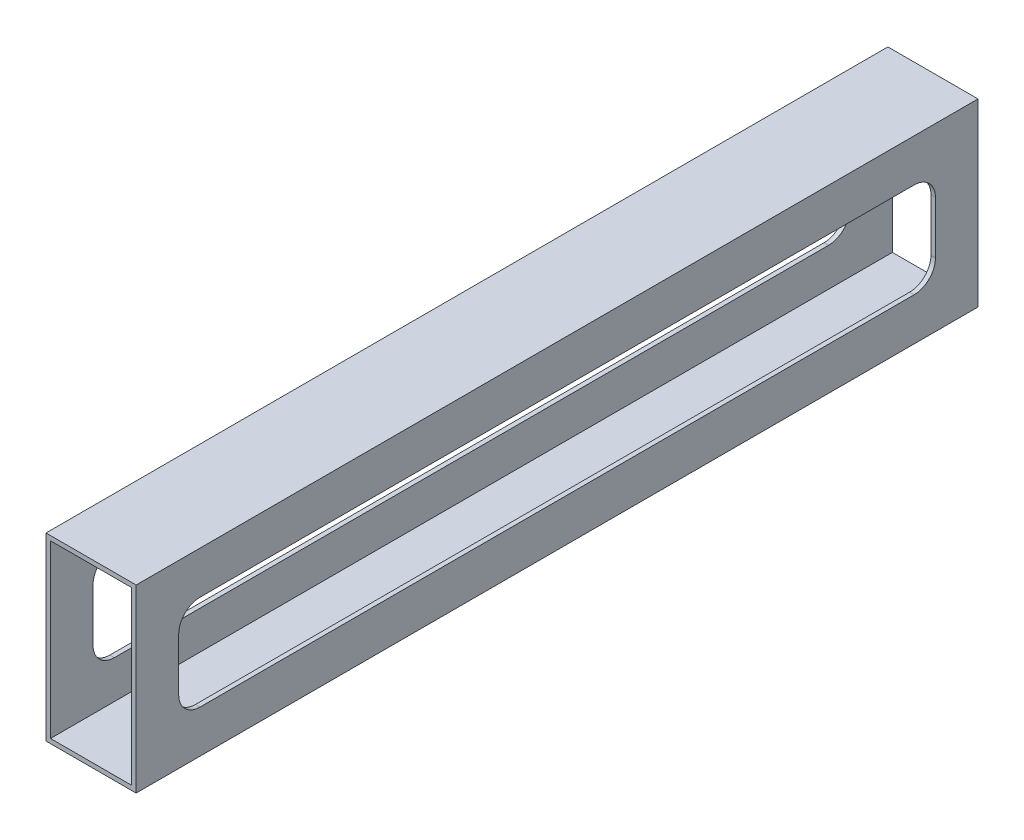
ISO-10303-21;
HEADER;
FILE_DESCRIPTION(('STEP AP214'),'2;1');
FILE_NAME('part.step','',(''),(''),'','','');
FILE_SCHEMA(('AUTOMOTIVE_DESIGN { 1 0 10303 214 1 1 1 1 }'));
ENDSEC;
DATA;
#1=APPLICATION_CONTEXT('core data for automotive mechanical design processes');
#2=APPLICATION_PROTOCOL_DEFINITION('international standard','automotive_design',2000,#1);
#3=PRODUCT_CONTEXT('',#1,'mechanical');
#4=PRODUCT('Part','Part','',(#3));
#5=PRODUCT_RELATED_PRODUCT_CATEGORY('part','',(#4));
#6=PRODUCT_DEFINITION_FORMATION('','',#4);
#7=PRODUCT_DEFINITION_CONTEXT('part definition',#1,'design');
#8=PRODUCT_DEFINITION('design','',#6,#7);
#9=PRODUCT_DEFINITION_SHAPE('','',#8);
#10=(LENGTH_UNIT() NAMED_UNIT(*) SI_UNIT(.MILLI.,.METRE.));
#11=(NAMED_UNIT(*) PLANE_ANGLE_UNIT() SI_UNIT($,.RADIAN.));
#12=(NAMED_UNIT(*) SI_UNIT($,.STERADIAN.) SOLID_ANGLE_UNIT());
#13=UNCERTAINTY_MEASURE_WITH_UNIT(LENGTH_MEASURE(1.E-05),#10,'distance_accuracy_value','');
#14=(GEOMETRIC_REPRESENTATION_CONTEXT(3) GLOBAL_UNCERTAINTY_ASSIGNED_CONTEXT((#13)) GLOBAL_UNIT_ASSIGNED_CONTEXT((#10,
#11,#12)) REPRESENTATION_CONTEXT('',''));
#15=CARTESIAN_POINT('',(0.,0.,0.));
#16=DIRECTION('',(0.,0.,1.));
#17=DIRECTION('',(1.,0.,0.));
#18=AXIS2_PLACEMENT_3D('',#15,#16,#17);
#19=CARTESIAN_POINT('',(0.,0.,0.));
#20=DIRECTION('',(0.,0.,-1.));
#21=DIRECTION('',(-1.,0.,0.));
#22=AXIS2_PLACEMENT_3D('',#19,#20,#21);
#23=PLANE('',#22);
#24=DIRECTION('',(0.,1.,0.));
#25=VECTOR('',#24,1.);
#26=CARTESIAN_POINT('',(-89.9570653423027,-37.2794955536291,0.));
#27=LINE('',#26,#25);
#28=CARTESIAN_POINT('',(-89.9570653423027,-37.2794955536291,0.));
#29=VERTEX_POINT('',#28);
#30=CARTESIAN_POINT('',(-89.9570653423027,13.5205044463709,0.));
#31=VERTEX_POINT('',#30);
#32=EDGE_CURVE('E312',#29,#31,#27,.T.);
#33=ORIENTED_EDGE('',*,*,#32,.F.);
#34=DIRECTION('',(1.,0.,0.));
#35=VECTOR('',#34,1.);
#36=CARTESIAN_POINT('',(-115.357065342303,-37.2794955536291,0.));
#37=LINE('',#36,#35);
#38=CARTESIAN_POINT('',(-115.357065342303,-37.2794955536291,0.));
#39=VERTEX_POINT('',#38);
#40=EDGE_CURVE('E297',#39,#29,#37,.T.);
#41=ORIENTED_EDGE('',*,*,#40,.F.);
#42=DIRECTION('',(0.,-1.,0.));
#43=VECTOR('',#42,1.);
#44=CARTESIAN_POINT('',(-115.357065342303,-37.2794955536291,0.));
#45=LINE('',#44,#43);
#46=CARTESIAN_POINT('',(-115.357065342303,13.5205044463709,0.));
#47=VERTEX_POINT('',#46);
#48=EDGE_CURVE('E302',#47,#39,#45,.T.);
#49=ORIENTED_EDGE('',*,*,#48,.F.);
#50=DIRECTION('',(-1.,0.,0.));
#51=VECTOR('',#50,1.);
#52=CARTESIAN_POINT('',(-115.357065342303,13.5205044463709,0.));
#53=LINE('',#52,#51);
#54=EDGE_CURVE('E307',#31,#47,#53,.T.);
#55=ORIENTED_EDGE('',*,*,#54,.F.);
#56=EDGE_LOOP('',(#33,#41,#49,#55));
#57=FACE_BOUND('',#56,.T.);
#58=DIRECTION('',(-1.,0.,0.));
#59=VECTOR('',#58,1.);
#60=CARTESIAN_POINT('',(-114.087065342303,12.2505044463709,0.));
#61=LINE('',#60,#59);
#62=CARTESIAN_POINT('',(-91.2270653423027,12.2505044463709,0.));
#63=VERTEX_POINT('',#62);
#64=CARTESIAN_POINT('',(-114.087065342303,12.2505044463709,0.));
#65=VERTEX_POINT('',#64);
#66=EDGE_CURVE('E296',#63,#65,#61,.T.);
#67=ORIENTED_EDGE('',*,*,#66,.T.);
#68=DIRECTION('',(0.,-1.,0.));
#69=VECTOR('',#68,1.);
#70=CARTESIAN_POINT('',(-114.087065342303,-36.0094955536291,0.));
#71=LINE('',#70,#69);
#72=CARTESIAN_POINT('',(-114.087065342303,-36.0094955536291,0.));
#73=VERTEX_POINT('',#72);
#74=EDGE_CURVE('E319',#65,#73,#71,.T.);
#75=ORIENTED_EDGE('',*,*,#74,.T.);
#76=DIRECTION('',(1.,0.,0.));
#77=VECTOR('',#76,1.);
#78=CARTESIAN_POINT('',(-114.087065342303,-36.0094955536291,0.));
#79=LINE('',#78,#77);
#80=CARTESIAN_POINT('',(-91.2270653423027,-36.0094955536291,0.));
#81=VERTEX_POINT('',#80);
#82=EDGE_CURVE('E324',#73,#81,#79,.T.);
#83=ORIENTED_EDGE('',*,*,#82,.T.);
#84=DIRECTION('',(0.,1.,0.));
#85=VECTOR('',#84,1.);
#86=CARTESIAN_POINT('',(-91.2270653423027,-36.0094955536291,0.));
#87=LINE('',#86,#85);
#88=EDGE_CURVE('E320',#81,#63,#87,.T.);
#89=ORIENTED_EDGE('',*,*,#88,.T.);
#90=EDGE_LOOP('',(#67,#75,#83,#89));
#91=FACE_BOUND('',#90,.T.);
#92=ADVANCED_FACE('F33',(#57,#91),#23,.T.);
#93=CARTESIAN_POINT('',(-89.9570653423027,-37.2794955536291,294.095626628495));
#94=DIRECTION('',(-1.,0.,0.));
#95=DIRECTION('',(0.,0.,1.));
#96=AXIS2_PLACEMENT_3D('',#93,#94,#95);
#97=PLANE('',#96);
#98=DIRECTION('',(0.,0.,1.));
#99=VECTOR('',#98,1.);
#100=CARTESIAN_POINT('',(-89.9570653423027,1.52050444637092,18.));
#101=LINE('',#100,#99);
#102=CARTESIAN_POINT('',(-89.9570653423027,1.52050444637093,18.));
#103=VERTEX_POINT('',#102);
#104=CARTESIAN_POINT('',(-89.9570653423027,1.52050444637092,219.2995));
#105=VERTEX_POINT('',#104);
#106=EDGE_CURVE('E240',#103,#105,#101,.T.);
#107=ORIENTED_EDGE('',*,*,#106,.F.);
#108=CARTESIAN_POINT('',(-89.9570653423027,-4.47949555362908,18.));
#109=DIRECTION('',(1.,0.,0.));
#110=DIRECTION('',(0.,0.,1.));
#111=AXIS2_PLACEMENT_3D('',#108,#109,#110);
#112=CIRCLE('',#111,6.);
#113=CARTESIAN_POINT('',(-89.9570653423027,-4.47949555362908,12.));
#114=VERTEX_POINT('',#113);
#115=EDGE_CURVE('E48',#114,#103,#112,.T.);
#116=ORIENTED_EDGE('',*,*,#115,.F.);
#117=DIRECTION('',(0.,1.,0.));
#118=VECTOR('',#117,1.);
#119=CARTESIAN_POINT('',(-89.9570653423027,-19.2794955536291,12.));
#120=LINE('',#119,#118);
#121=CARTESIAN_POINT('',(-89.9570653423027,-19.2794955536291,12.));
#122=VERTEX_POINT('',#121);
#123=EDGE_CURVE('E220',#122,#114,#120,.T.);
#124=ORIENTED_EDGE('',*,*,#123,.F.);
#125=CARTESIAN_POINT('',(-89.9570653423027,-19.2794955536291,18.));
#126=DIRECTION('',(1.,0.,0.));
#127=DIRECTION('',(0.,0.,-1.));
#128=AXIS2_PLACEMENT_3D('',#125,#126,#127);
#129=CIRCLE('',#128,6.00000000000001);
#130=CARTESIAN_POINT('',(-89.9570653423027,-25.2794955536291,18.));
#131=VERTEX_POINT('',#130);
#132=EDGE_CURVE('E223',#131,#122,#129,.T.);
#133=ORIENTED_EDGE('',*,*,#132,.F.);
#134=DIRECTION('',(0.,0.,-1.));
#135=VECTOR('',#134,1.);
#136=CARTESIAN_POINT('',(-89.9570653423027,-25.2794955536291,219.2995));
#137=LINE('',#136,#135);
#138=CARTESIAN_POINT('',(-89.9570653423027,-25.2794955536291,219.2995));
#139=VERTEX_POINT('',#138);
#140=EDGE_CURVE('E252',#139,#131,#137,.T.);
#141=ORIENTED_EDGE('',*,*,#140,.F.);
#142=CARTESIAN_POINT('',(-89.9570653423027,-19.2794955536291,219.2995));
#143=DIRECTION('',(1.,0.,0.));
#144=DIRECTION('',(0.,0.,-1.));
#145=AXIS2_PLACEMENT_3D('',#142,#143,#144);
#146=CIRCLE('',#145,6.00000000000002);
#147=CARTESIAN_POINT('',(-89.9570653423027,-19.2794955536291,225.2995));
#148=VERTEX_POINT('',#147);
#149=EDGE_CURVE('E249',#148,#139,#146,.T.);
#150=ORIENTED_EDGE('',*,*,#149,.F.);
#151=DIRECTION('',(0.,-1.,0.));
#152=VECTOR('',#151,1.);
#153=CARTESIAN_POINT('',(-89.9570653423027,-4.47949555362908,225.2995));
#154=LINE('',#153,#152);
#155=CARTESIAN_POINT('',(-89.9570653423027,-4.47949555362908,225.2995));
#156=VERTEX_POINT('',#155);
#157=EDGE_CURVE('E246',#156,#148,#154,.T.);
#158=ORIENTED_EDGE('',*,*,#157,.F.);
#159=CARTESIAN_POINT('',(-89.9570653423027,-4.47949555362908,219.2995));
#160=DIRECTION('',(1.,0.,0.));
#161=DIRECTION('',(0.,0.,-1.));
#162=AXIS2_PLACEMENT_3D('',#159,#160,#161);
#163=CIRCLE('',#162,6.00000000000002);
#164=EDGE_CURVE('E243',#105,#156,#163,.T.);
#165=ORIENTED_EDGE('',*,*,#164,.F.);
#166=EDGE_LOOP('',(#107,#116,#124,#133,#141,#150,#158,#165));
#167=FACE_BOUND('',#166,.T.);
#168=DIRECTION('',(0.,0.,-1.));
#169=VECTOR('',#168,1.);
#170=CARTESIAN_POINT('',(-89.9570653423027,13.5205044463709,294.095626628495));
#171=LINE('',#170,#169);
#172=CARTESIAN_POINT('',(-89.9570653423027,13.5205044463709,237.2995));
#173=VERTEX_POINT('',#172);
#174=EDGE_CURVE('E311',#173,#31,#171,.T.);
#175=ORIENTED_EDGE('',*,*,#174,.F.);
#176=DIRECTION('',(0.,-1.,0.));
#177=VECTOR('',#176,1.);
#178=CARTESIAN_POINT('',(-89.9570653423027,-37.2794955536291,237.2995));
#179=LINE('',#178,#177);
#180=CARTESIAN_POINT('',(-89.9570653423027,-37.2794955536291,237.2995));
#181=VERTEX_POINT('',#180);
#182=EDGE_CURVE('E323',#173,#181,#179,.T.);
#183=ORIENTED_EDGE('',*,*,#182,.T.);
#184=DIRECTION('',(0.,0.,-1.));
#185=VECTOR('',#184,1.);
#186=CARTESIAN_POINT('',(-89.9570653423027,-37.2794955536291,294.095626628495));
#187=LINE('',#186,#185);
#188=EDGE_CURVE('E316',#181,#29,#187,.T.);
#189=ORIENTED_EDGE('',*,*,#188,.T.);
#190=ORIENTED_EDGE('',*,*,#32,.T.);
#191=EDGE_LOOP('',(#175,#183,#189,#190));
#192=FACE_BOUND('',#191,.T.);
#193=ADVANCED_FACE('F397',(#167,#192),#97,.F.);
#194=CARTESIAN_POINT('',(-115.357065342303,13.5205044463709,294.095626628495));
#195=DIRECTION('',(0.,-1.,0.));
#196=DIRECTION('',(0.,0.,-1.));
#197=AXIS2_PLACEMENT_3D('',#194,#195,#196);
#198=PLANE('',#197);
#199=DIRECTION('',(0.,0.,-1.));
#200=VECTOR('',#199,1.);
#201=CARTESIAN_POINT('',(-115.357065342303,13.5205044463709,294.095626628495));
#202=LINE('',#201,#200);
#203=CARTESIAN_POINT('',(-115.357065342303,13.5205044463709,237.2995));
#204=VERTEX_POINT('',#203);
#205=EDGE_CURVE('E306',#204,#47,#202,.T.);
#206=ORIENTED_EDGE('',*,*,#205,.F.);
#207=DIRECTION('',(1.,0.,0.));
#208=VECTOR('',#207,1.);
#209=CARTESIAN_POINT('',(-115.357065342303,13.5205044463709,237.2995));
#210=LINE('',#209,#208);
#211=EDGE_CURVE('E315',#204,#173,#210,.T.);
#212=ORIENTED_EDGE('',*,*,#211,.T.);
#213=ORIENTED_EDGE('',*,*,#174,.T.);
#214=ORIENTED_EDGE('',*,*,#54,.T.);
#215=EDGE_LOOP('',(#206,#212,#213,#214));
#216=FACE_BOUND('',#215,.T.);
#217=ADVANCED_FACE('F429',(#216),#198,.F.);
#218=CARTESIAN_POINT('',(-115.357065342303,-37.2794955536291,294.095626628495));
#219=DIRECTION('',(1.,0.,0.));
#220=DIRECTION('',(0.,1.,0.));
#221=AXIS2_PLACEMENT_3D('',#218,#219,#220);
#222=PLANE('',#221);
#223=DIRECTION('',(0.,1.,0.));
#224=VECTOR('',#223,1.);
#225=CARTESIAN_POINT('',(-115.357065342303,-19.2794955536291,12.));
#226=LINE('',#225,#224);
#227=CARTESIAN_POINT('',(-115.357065342303,-19.2794955536291,12.));
#228=VERTEX_POINT('',#227);
#229=CARTESIAN_POINT('',(-115.357065342303,-4.47949555362908,12.));
#230=VERTEX_POINT('',#229);
#231=EDGE_CURVE('E219',#228,#230,#226,.T.);
#232=ORIENTED_EDGE('',*,*,#231,.T.);
#233=CARTESIAN_POINT('',(-115.357065342303,-4.47949555362908,18.));
#234=DIRECTION('',(1.,0.,0.));
#235=DIRECTION('',(0.,0.,1.));
#236=AXIS2_PLACEMENT_3D('',#233,#234,#235);
#237=CIRCLE('',#236,6.);
#238=CARTESIAN_POINT('',(-115.357065342303,1.52050444637092,18.));
#239=VERTEX_POINT('',#238);
#240=EDGE_CURVE('E200',#230,#239,#237,.T.);
#241=ORIENTED_EDGE('',*,*,#240,.T.);
#242=DIRECTION('',(0.,0.,1.));
#243=VECTOR('',#242,1.);
#244=CARTESIAN_POINT('',(-115.357065342303,1.52050444637092,18.));
#245=LINE('',#244,#243);
#246=CARTESIAN_POINT('',(-115.357065342303,1.52050444637093,219.2995));
#247=VERTEX_POINT('',#246);
#248=EDGE_CURVE('E210',#239,#247,#245,.T.);
#249=ORIENTED_EDGE('',*,*,#248,.T.);
#250=CARTESIAN_POINT('',(-115.357065342303,-4.47949555362908,219.2995));
#251=DIRECTION('',(1.,0.,0.));
#252=DIRECTION('',(0.,0.,-1.));
#253=AXIS2_PLACEMENT_3D('',#250,#251,#252);
#254=CIRCLE('',#253,6.00000000000002);
#255=CARTESIAN_POINT('',(-115.357065342303,-4.47949555362908,225.2995));
#256=VERTEX_POINT('',#255);
#257=EDGE_CURVE('E56',#247,#256,#254,.T.);
#258=ORIENTED_EDGE('',*,*,#257,.T.);
#259=DIRECTION('',(0.,-1.,0.));
#260=VECTOR('',#259,1.);
#261=CARTESIAN_POINT('',(-115.357065342303,-4.47949555362908,225.2995));
#262=LINE('',#261,#260);
#263=CARTESIAN_POINT('',(-115.357065342303,-19.2794955536291,225.2995));
#264=VERTEX_POINT('',#263);
#265=EDGE_CURVE('E227',#256,#264,#262,.T.);
#266=ORIENTED_EDGE('',*,*,#265,.T.);
#267=CARTESIAN_POINT('',(-115.357065342303,-19.2794955536291,219.2995));
#268=DIRECTION('',(1.,0.,0.));
#269=DIRECTION('',(0.,0.,-1.));
#270=AXIS2_PLACEMENT_3D('',#267,#268,#269);
#271=CIRCLE('',#270,6.00000000000002);
#272=CARTESIAN_POINT('',(-115.357065342303,-25.2794955536291,219.2995));
#273=VERTEX_POINT('',#272);
#274=EDGE_CURVE('E230',#264,#273,#271,.T.);
#275=ORIENTED_EDGE('',*,*,#274,.T.);
#276=DIRECTION('',(0.,0.,-1.));
#277=VECTOR('',#276,1.);
#278=CARTESIAN_POINT('',(-115.357065342303,-25.2794955536291,219.2995));
#279=LINE('',#278,#277);
#280=CARTESIAN_POINT('',(-115.357065342303,-25.2794955536291,18.));
#281=VERTEX_POINT('',#280);
#282=EDGE_CURVE('E233',#273,#281,#279,.T.);
#283=ORIENTED_EDGE('',*,*,#282,.T.);
#284=CARTESIAN_POINT('',(-115.357065342303,-19.2794955536291,18.));
#285=DIRECTION('',(1.,0.,0.));
#286=DIRECTION('',(0.,0.,-1.));
#287=AXIS2_PLACEMENT_3D('',#284,#285,#286);
#288=CIRCLE('',#287,6.00000000000001);
#289=EDGE_CURVE('E236',#281,#228,#288,.T.);
#290=ORIENTED_EDGE('',*,*,#289,.T.);
#291=EDGE_LOOP('',(#232,#241,#249,#258,#266,#275,#283,#290));
#292=FACE_BOUND('',#291,.T.);
#293=DIRECTION('',(0.,0.,-1.));
#294=VECTOR('',#293,1.);
#295=CARTESIAN_POINT('',(-115.357065342303,-37.2794955536291,294.095626628495));
#296=LINE('',#295,#294);
#297=CARTESIAN_POINT('',(-115.357065342303,-37.2794955536291,237.2995));
#298=VERTEX_POINT('',#297);
#299=EDGE_CURVE('E301',#298,#39,#296,.T.);
#300=ORIENTED_EDGE('',*,*,#299,.F.);
#301=DIRECTION('',(0.,1.,0.));
#302=VECTOR('',#301,1.);
#303=CARTESIAN_POINT('',(-115.357065342303,-37.2794955536291,237.2995));
#304=LINE('',#303,#302);
#305=EDGE_CURVE('E310',#298,#204,#304,.T.);
#306=ORIENTED_EDGE('',*,*,#305,.T.);
#307=ORIENTED_EDGE('',*,*,#205,.T.);
#308=ORIENTED_EDGE('',*,*,#48,.T.);
#309=EDGE_LOOP('',(#300,#306,#307,#308));
#310=FACE_BOUND('',#309,.T.);
#311=ADVANCED_FACE('F215',(#292,#310),#222,.F.);
#312=CARTESIAN_POINT('',(-115.357065342303,-37.2794955536291,294.095626628495));
#313=DIRECTION('',(0.,1.,0.));
#314=DIRECTION('',(0.,0.,1.));
#315=AXIS2_PLACEMENT_3D('',#312,#313,#314);
#316=PLANE('',#315);
#317=ORIENTED_EDGE('',*,*,#188,.F.);
#318=DIRECTION('',(-1.,0.,0.));
#319=VECTOR('',#318,1.);
#320=CARTESIAN_POINT('',(-115.357065342303,-37.2794955536291,237.2995));
#321=LINE('',#320,#319);
#322=EDGE_CURVE('E305',#181,#298,#321,.T.);
#323=ORIENTED_EDGE('',*,*,#322,.T.);
#324=ORIENTED_EDGE('',*,*,#299,.T.);
#325=ORIENTED_EDGE('',*,*,#40,.T.);
#326=EDGE_LOOP('',(#317,#323,#324,#325));
#327=FACE_BOUND('',#326,.T.);
#328=ADVANCED_FACE('F436',(#327),#316,.F.);
#329=CARTESIAN_POINT('',(-114.087065342303,-36.0094955536291,294.095626628495));
#330=DIRECTION('',(1.,0.,0.));
#331=DIRECTION('',(0.,0.,-1.));
#332=AXIS2_PLACEMENT_3D('',#329,#330,#331);
#333=PLANE('',#332);
#334=CARTESIAN_POINT('',(-114.087065342303,-4.47949555362908,18.));
#335=DIRECTION('',(1.,0.,0.));
#336=DIRECTION('',(0.,0.,-1.));
#337=AXIS2_PLACEMENT_3D('',#334,#335,#336);
#338=CIRCLE('',#337,6.);
#339=CARTESIAN_POINT('',(-114.087065342303,-4.47949555362908,12.));
#340=VERTEX_POINT('',#339);
#341=CARTESIAN_POINT('',(-114.087065342303,1.52050444637092,18.));
#342=VERTEX_POINT('',#341);
#343=EDGE_CURVE('E203',#340,#342,#338,.T.);
#344=ORIENTED_EDGE('',*,*,#343,.F.);
#345=DIRECTION('',(0.,1.,0.));
#346=VECTOR('',#345,1.);
#347=CARTESIAN_POINT('',(-114.087065342303,-36.0094955536291,12.));
#348=LINE('',#347,#346);
#349=CARTESIAN_POINT('',(-114.087065342303,-19.2794955536291,12.));
#350=VERTEX_POINT('',#349);
#351=EDGE_CURVE('E293',#350,#340,#348,.T.);
#352=ORIENTED_EDGE('',*,*,#351,.F.);
#353=CARTESIAN_POINT('',(-114.087065342303,-19.2794955536291,18.));
#354=DIRECTION('',(1.,0.,0.));
#355=DIRECTION('',(0.,0.,-1.));
#356=AXIS2_PLACEMENT_3D('',#353,#354,#355);
#357=CIRCLE('',#356,6.00000000000001);
#358=CARTESIAN_POINT('',(-114.087065342303,-25.2794955536291,18.));
#359=VERTEX_POINT('',#358);
#360=EDGE_CURVE('E291',#359,#350,#357,.T.);
#361=ORIENTED_EDGE('',*,*,#360,.F.);
#362=DIRECTION('',(0.,0.,-1.));
#363=VECTOR('',#362,1.);
#364=CARTESIAN_POINT('',(-114.087065342303,-25.2794955536291,294.095626628495));
#365=LINE('',#364,#363);
#366=CARTESIAN_POINT('',(-114.087065342303,-25.2794955536291,219.2995));
#367=VERTEX_POINT('',#366);
#368=EDGE_CURVE('E289',#367,#359,#365,.T.);
#369=ORIENTED_EDGE('',*,*,#368,.F.);
#370=CARTESIAN_POINT('',(-114.087065342303,-19.2794955536291,219.2995));
#371=DIRECTION('',(1.,0.,0.));
#372=DIRECTION('',(0.,0.,-1.));
#373=AXIS2_PLACEMENT_3D('',#370,#371,#372);
#374=CIRCLE('',#373,6.00000000000002);
#375=CARTESIAN_POINT('',(-114.087065342303,-19.2794955536291,225.2995));
#376=VERTEX_POINT('',#375);
#377=EDGE_CURVE('E287',#376,#367,#374,.T.);
#378=ORIENTED_EDGE('',*,*,#377,.F.);
#379=DIRECTION('',(0.,-1.,0.));
#380=VECTOR('',#379,1.);
#381=CARTESIAN_POINT('',(-114.087065342303,-36.0094955536291,225.2995));
#382=LINE('',#381,#380);
#383=CARTESIAN_POINT('',(-114.087065342303,-4.47949555362908,225.2995));
#384=VERTEX_POINT('',#383);
#385=EDGE_CURVE('E285',#384,#376,#382,.T.);
#386=ORIENTED_EDGE('',*,*,#385,.F.);
#387=CARTESIAN_POINT('',(-114.087065342303,-4.47949555362908,219.2995));
#388=DIRECTION('',(1.,0.,0.));
#389=DIRECTION('',(0.,0.,-1.));
#390=AXIS2_PLACEMENT_3D('',#387,#388,#389);
#391=CIRCLE('',#390,6.00000000000002);
#392=CARTESIAN_POINT('',(-114.087065342303,1.52050444637092,219.2995));
#393=VERTEX_POINT('',#392);
#394=EDGE_CURVE('E283',#393,#384,#391,.T.);
#395=ORIENTED_EDGE('',*,*,#394,.F.);
#396=DIRECTION('',(0.,0.,1.));
#397=VECTOR('',#396,1.);
#398=CARTESIAN_POINT('',(-114.087065342303,1.52050444637092,294.095626628495));
#399=LINE('',#398,#397);
#400=EDGE_CURVE('E259',#342,#393,#399,.T.);
#401=ORIENTED_EDGE('',*,*,#400,.F.);
#402=EDGE_LOOP('',(#344,#352,#361,#369,#378,#386,#395,#401));
#403=FACE_BOUND('',#402,.T.);
#404=DIRECTION('',(0.,1.,0.));
#405=VECTOR('',#404,1.);
#406=CARTESIAN_POINT('',(-114.087065342303,-36.0094955536291,237.2995));
#407=LINE('',#406,#405);
#408=CARTESIAN_POINT('',(-114.087065342303,-36.0094955536291,237.2995));
#409=VERTEX_POINT('',#408);
#410=CARTESIAN_POINT('',(-114.087065342303,12.2505044463709,237.2995));
#411=VERTEX_POINT('',#410);
#412=EDGE_CURVE('E332',#409,#411,#407,.T.);
#413=ORIENTED_EDGE('',*,*,#412,.F.);
#414=DIRECTION('',(0.,0.,-1.));
#415=VECTOR('',#414,1.);
#416=CARTESIAN_POINT('',(-114.087065342303,-36.0094955536291,294.095626628495));
#417=LINE('',#416,#415);
#418=EDGE_CURVE('E300',#409,#73,#417,.T.);
#419=ORIENTED_EDGE('',*,*,#418,.T.);
#420=ORIENTED_EDGE('',*,*,#74,.F.);
#421=DIRECTION('',(0.,0.,-1.));
#422=VECTOR('',#421,1.);
#423=CARTESIAN_POINT('',(-114.087065342303,12.2505044463709,294.095626628495));
#424=LINE('',#423,#422);
#425=EDGE_CURVE('E342',#411,#65,#424,.T.);
#426=ORIENTED_EDGE('',*,*,#425,.F.);
#427=EDGE_LOOP('',(#413,#419,#420,#426));
#428=FACE_BOUND('',#427,.T.);
#429=ADVANCED_FACE('F439',(#403,#428),#333,.T.);
#430=CARTESIAN_POINT('',(-114.087065342303,-36.0094955536291,294.095626628495));
#431=DIRECTION('',(0.,1.,0.));
#432=DIRECTION('',(0.,0.,1.));
#433=AXIS2_PLACEMENT_3D('',#430,#431,#432);
#434=PLANE('',#433);
#435=DIRECTION('',(-1.,0.,0.));
#436=VECTOR('',#435,1.);
#437=CARTESIAN_POINT('',(-114.087065342303,-36.0094955536291,237.2995));
#438=LINE('',#437,#436);
#439=CARTESIAN_POINT('',(-91.2270653423027,-36.0094955536291,237.2995));
#440=VERTEX_POINT('',#439);
#441=EDGE_CURVE('E353',#440,#409,#438,.T.);
#442=ORIENTED_EDGE('',*,*,#441,.F.);
#443=DIRECTION('',(0.,0.,-1.));
#444=VECTOR('',#443,1.);
#445=CARTESIAN_POINT('',(-91.2270653423027,-36.0094955536291,294.095626628495));
#446=LINE('',#445,#444);
#447=EDGE_CURVE('E338',#440,#81,#446,.T.);
#448=ORIENTED_EDGE('',*,*,#447,.T.);
#449=ORIENTED_EDGE('',*,*,#82,.F.);
#450=ORIENTED_EDGE('',*,*,#418,.F.);
#451=EDGE_LOOP('',(#442,#448,#449,#450));
#452=FACE_BOUND('',#451,.T.);
#453=ADVANCED_FACE('F452',(#452),#434,.T.);
#454=CARTESIAN_POINT('',(-91.2270653423027,-36.0094955536291,294.095626628495));
#455=DIRECTION('',(-1.,0.,0.));
#456=DIRECTION('',(0.,0.,1.));
#457=AXIS2_PLACEMENT_3D('',#454,#455,#456);
#458=PLANE('',#457);
#459=CARTESIAN_POINT('',(-91.2270653423027,-4.47949555362908,18.));
#460=DIRECTION('',(-1.,0.,0.));
#461=DIRECTION('',(0.,0.,1.));
#462=AXIS2_PLACEMENT_3D('',#459,#460,#461);
#463=CIRCLE('',#462,6.);
#464=CARTESIAN_POINT('',(-91.2270653423027,1.52050444637092,18.));
#465=VERTEX_POINT('',#464);
#466=CARTESIAN_POINT('',(-91.2270653423027,-4.47949555362908,12.));
#467=VERTEX_POINT('',#466);
#468=EDGE_CURVE('E11',#465,#467,#463,.T.);
#469=ORIENTED_EDGE('',*,*,#468,.F.);
#470=DIRECTION('',(0.,0.,-1.));
#471=VECTOR('',#470,1.);
#472=CARTESIAN_POINT('',(-91.2270653423027,1.52050444637092,294.095626628495));
#473=LINE('',#472,#471);
#474=CARTESIAN_POINT('',(-91.2270653423027,1.52050444637092,219.2995));
#475=VERTEX_POINT('',#474);
#476=EDGE_CURVE('E355',#475,#465,#473,.T.);
#477=ORIENTED_EDGE('',*,*,#476,.F.);
#478=CARTESIAN_POINT('',(-91.2270653423027,-4.47949555362908,219.2995));
#479=DIRECTION('',(-1.,0.,0.));
#480=DIRECTION('',(0.,0.,1.));
#481=AXIS2_PLACEMENT_3D('',#478,#479,#480);
#482=CIRCLE('',#481,6.00000000000002);
#483=CARTESIAN_POINT('',(-91.2270653423027,-4.47949555362908,225.2995));
#484=VERTEX_POINT('',#483);
#485=EDGE_CURVE('E358',#484,#475,#482,.T.);
#486=ORIENTED_EDGE('',*,*,#485,.F.);
#487=DIRECTION('',(0.,1.,0.));
#488=VECTOR('',#487,1.);
#489=CARTESIAN_POINT('',(-91.2270653423027,-36.0094955536291,225.2995));
#490=LINE('',#489,#488);
#491=CARTESIAN_POINT('',(-91.2270653423027,-19.2794955536291,225.2995));
#492=VERTEX_POINT('',#491);
#493=EDGE_CURVE('E361',#492,#484,#490,.T.);
#494=ORIENTED_EDGE('',*,*,#493,.F.);
#495=CARTESIAN_POINT('',(-91.2270653423027,-19.2794955536291,219.2995));
#496=DIRECTION('',(-1.,0.,0.));
#497=DIRECTION('',(0.,0.,1.));
#498=AXIS2_PLACEMENT_3D('',#495,#496,#497);
#499=CIRCLE('',#498,6.00000000000002);
#500=CARTESIAN_POINT('',(-91.2270653423027,-25.2794955536291,219.2995));
#501=VERTEX_POINT('',#500);
#502=EDGE_CURVE('E363',#501,#492,#499,.T.);
#503=ORIENTED_EDGE('',*,*,#502,.F.);
#504=DIRECTION('',(0.,0.,1.));
#505=VECTOR('',#504,1.);
#506=CARTESIAN_POINT('',(-91.2270653423027,-25.2794955536291,294.095626628495));
#507=LINE('',#506,#505);
#508=CARTESIAN_POINT('',(-91.2270653423027,-25.2794955536291,18.));
#509=VERTEX_POINT('',#508);
#510=EDGE_CURVE('E365',#509,#501,#507,.T.);
#511=ORIENTED_EDGE('',*,*,#510,.F.);
#512=CARTESIAN_POINT('',(-91.2270653423027,-19.2794955536291,18.));
#513=DIRECTION('',(-1.,0.,0.));
#514=DIRECTION('',(0.,0.,1.));
#515=AXIS2_PLACEMENT_3D('',#512,#513,#514);
#516=CIRCLE('',#515,6.00000000000001);
#517=CARTESIAN_POINT('',(-91.2270653423027,-19.2794955536291,12.));
#518=VERTEX_POINT('',#517);
#519=EDGE_CURVE('E367',#518,#509,#516,.T.);
#520=ORIENTED_EDGE('',*,*,#519,.F.);
#521=DIRECTION('',(0.,-1.,0.));
#522=VECTOR('',#521,1.);
#523=CARTESIAN_POINT('',(-91.2270653423027,-36.0094955536291,12.));
#524=LINE('',#523,#522);
#525=EDGE_CURVE('E41',#467,#518,#524,.T.);
#526=ORIENTED_EDGE('',*,*,#525,.F.);
#527=EDGE_LOOP('',(#469,#477,#486,#494,#503,#511,#520,#526));
#528=FACE_BOUND('',#527,.T.);
#529=DIRECTION('',(0.,-1.,0.));
#530=VECTOR('',#529,1.);
#531=CARTESIAN_POINT('',(-91.2270653423027,-36.0094955536291,237.2995));
#532=LINE('',#531,#530);
#533=CARTESIAN_POINT('',(-91.2270653423027,12.2505044463709,237.2995));
#534=VERTEX_POINT('',#533);
#535=EDGE_CURVE('E331',#534,#440,#532,.T.);
#536=ORIENTED_EDGE('',*,*,#535,.F.);
#537=DIRECTION('',(0.,0.,-1.));
#538=VECTOR('',#537,1.);
#539=CARTESIAN_POINT('',(-91.2270653423027,12.2505044463709,294.095626628495));
#540=LINE('',#539,#538);
#541=EDGE_CURVE('E340',#534,#63,#540,.T.);
#542=ORIENTED_EDGE('',*,*,#541,.T.);
#543=ORIENTED_EDGE('',*,*,#88,.F.);
#544=ORIENTED_EDGE('',*,*,#447,.F.);
#545=EDGE_LOOP('',(#536,#542,#543,#544));
#546=FACE_BOUND('',#545,.T.);
#547=ADVANCED_FACE('F382',(#528,#546),#458,.T.);
#548=CARTESIAN_POINT('',(-114.087065342303,12.2505044463709,294.095626628495));
#549=DIRECTION('',(0.,-1.,0.));
#550=DIRECTION('',(0.,0.,-1.));
#551=AXIS2_PLACEMENT_3D('',#548,#549,#550);
#552=PLANE('',#551);
#553=DIRECTION('',(1.,0.,0.));
#554=VECTOR('',#553,1.);
#555=CARTESIAN_POINT('',(-114.087065342303,12.2505044463709,237.2995));
#556=LINE('',#555,#554);
#557=EDGE_CURVE('E329',#411,#534,#556,.T.);
#558=ORIENTED_EDGE('',*,*,#557,.F.);
#559=ORIENTED_EDGE('',*,*,#425,.T.);
#560=ORIENTED_EDGE('',*,*,#66,.F.);
#561=ORIENTED_EDGE('',*,*,#541,.F.);
#562=EDGE_LOOP('',(#558,#559,#560,#561));
#563=FACE_BOUND('',#562,.T.);
#564=ADVANCED_FACE('F446',(#563),#552,.T.);
#565=CARTESIAN_POINT('',(0.,0.,237.2995));
#566=DIRECTION('',(0.,0.,-1.));
#567=DIRECTION('',(-1.,0.,0.));
#568=AXIS2_PLACEMENT_3D('',#565,#566,#567);
#569=PLANE('',#568);
#570=ORIENTED_EDGE('',*,*,#412,.T.);
#571=ORIENTED_EDGE('',*,*,#557,.T.);
#572=ORIENTED_EDGE('',*,*,#535,.T.);
#573=ORIENTED_EDGE('',*,*,#441,.T.);
#574=EDGE_LOOP('',(#570,#571,#572,#573));
#575=FACE_BOUND('',#574,.T.);
#576=ORIENTED_EDGE('',*,*,#211,.F.);
#577=ORIENTED_EDGE('',*,*,#305,.F.);
#578=ORIENTED_EDGE('',*,*,#322,.F.);
#579=ORIENTED_EDGE('',*,*,#182,.F.);
#580=EDGE_LOOP('',(#576,#577,#578,#579));
#581=FACE_BOUND('',#580,.T.);
#582=ADVANCED_FACE('F35',(#575,#581),#569,.F.);
#583=CARTESIAN_POINT('',(-115.357065342303,1.52050444637092,18.));
#584=DIRECTION('',(0.,1.,0.));
#585=DIRECTION('',(0.,0.,1.));
#586=AXIS2_PLACEMENT_3D('',#583,#584,#585);
#587=PLANE('',#586);
#588=ORIENTED_EDGE('',*,*,#476,.T.);
#589=DIRECTION('',(1.,0.,0.));
#590=VECTOR('',#589,1.);
#591=CARTESIAN_POINT('',(-115.357065342303,1.52050444637092,18.));
#592=LINE('',#591,#590);
#593=EDGE_CURVE('E207',#465,#103,#592,.T.);
#594=ORIENTED_EDGE('',*,*,#593,.T.);
#595=ORIENTED_EDGE('',*,*,#106,.T.);
#596=DIRECTION('',(1.,0.,0.));
#597=VECTOR('',#596,1.);
#598=CARTESIAN_POINT('',(-115.357065342303,1.52050444637092,219.2995));
#599=LINE('',#598,#597);
#600=EDGE_CURVE('E206',#475,#105,#599,.T.);
#601=ORIENTED_EDGE('',*,*,#600,.F.);
#602=EDGE_LOOP('',(#588,#594,#595,#601));
#603=FACE_BOUND('',#602,.T.);
#604=ADVANCED_FACE('F401',(#603),#587,.F.);
#605=CARTESIAN_POINT('',(-115.357065342303,-4.47949555362908,219.2995));
#606=DIRECTION('',(1.,0.,0.));
#607=DIRECTION('',(0.,0.,-1.));
#608=AXIS2_PLACEMENT_3D('',#605,#606,#607);
#609=CYLINDRICAL_SURFACE('',#608,6.00000000000002);
#610=ORIENTED_EDGE('',*,*,#485,.T.);
#611=ORIENTED_EDGE('',*,*,#600,.T.);
#612=ORIENTED_EDGE('',*,*,#164,.T.);
#613=DIRECTION('',(1.,0.,0.));
#614=VECTOR('',#613,1.);
#615=CARTESIAN_POINT('',(-115.357065342303,-4.47949555362908,225.2995));
#616=LINE('',#615,#614);
#617=EDGE_CURVE('E280',#484,#156,#616,.T.);
#618=ORIENTED_EDGE('',*,*,#617,.F.);
#619=EDGE_LOOP('',(#610,#611,#612,#618));
#620=FACE_BOUND('',#619,.T.);
#621=ADVANCED_FACE('F407',(#620),#609,.F.);
#622=CARTESIAN_POINT('',(-115.357065342303,-4.47949555362908,225.2995));
#623=DIRECTION('',(0.,0.,1.));
#624=DIRECTION('',(1.,0.,0.));
#625=AXIS2_PLACEMENT_3D('',#622,#623,#624);
#626=PLANE('',#625);
#627=ORIENTED_EDGE('',*,*,#493,.T.);
#628=ORIENTED_EDGE('',*,*,#617,.T.);
#629=ORIENTED_EDGE('',*,*,#157,.T.);
#630=DIRECTION('',(1.,0.,0.));
#631=VECTOR('',#630,1.);
#632=CARTESIAN_POINT('',(-115.357065342303,-19.2794955536291,225.2995));
#633=LINE('',#632,#631);
#634=EDGE_CURVE('E276',#492,#148,#633,.T.);
#635=ORIENTED_EDGE('',*,*,#634,.F.);
#636=EDGE_LOOP('',(#627,#628,#629,#635));
#637=FACE_BOUND('',#636,.T.);
#638=ADVANCED_FACE('F409',(#637),#626,.F.);
#639=CARTESIAN_POINT('',(-115.357065342303,-19.2794955536291,219.2995));
#640=DIRECTION('',(1.,0.,0.));
#641=DIRECTION('',(0.,0.,-1.));
#642=AXIS2_PLACEMENT_3D('',#639,#640,#641);
#643=CYLINDRICAL_SURFACE('',#642,6.00000000000002);
#644=ORIENTED_EDGE('',*,*,#502,.T.);
#645=ORIENTED_EDGE('',*,*,#634,.T.);
#646=ORIENTED_EDGE('',*,*,#149,.T.);
#647=DIRECTION('',(1.,0.,0.));
#648=VECTOR('',#647,1.);
#649=CARTESIAN_POINT('',(-115.357065342303,-25.2794955536291,219.2995));
#650=LINE('',#649,#648);
#651=EDGE_CURVE('E272',#501,#139,#650,.T.);
#652=ORIENTED_EDGE('',*,*,#651,.F.);
#653=EDGE_LOOP('',(#644,#645,#646,#652));
#654=FACE_BOUND('',#653,.T.);
#655=ADVANCED_FACE('F390',(#654),#643,.F.);
#656=CARTESIAN_POINT('',(-115.357065342303,-25.2794955536291,219.2995));
#657=DIRECTION('',(0.,-1.,0.));
#658=DIRECTION('',(0.,0.,-1.));
#659=AXIS2_PLACEMENT_3D('',#656,#657,#658);
#660=PLANE('',#659);
#661=ORIENTED_EDGE('',*,*,#510,.T.);
#662=ORIENTED_EDGE('',*,*,#651,.T.);
#663=ORIENTED_EDGE('',*,*,#140,.T.);
#664=DIRECTION('',(1.,0.,0.));
#665=VECTOR('',#664,1.);
#666=CARTESIAN_POINT('',(-115.357065342303,-25.2794955536291,18.));
#667=LINE('',#666,#665);
#668=EDGE_CURVE('E268',#509,#131,#667,.T.);
#669=ORIENTED_EDGE('',*,*,#668,.F.);
#670=EDGE_LOOP('',(#661,#662,#663,#669));
#671=FACE_BOUND('',#670,.T.);
#672=ADVANCED_FACE('F388',(#671),#660,.F.);
#673=CARTESIAN_POINT('',(-115.357065342303,-19.2794955536291,18.));
#674=DIRECTION('',(1.,0.,0.));
#675=DIRECTION('',(0.,0.,-1.));
#676=AXIS2_PLACEMENT_3D('',#673,#674,#675);
#677=CYLINDRICAL_SURFACE('',#676,6.00000000000001);
#678=ORIENTED_EDGE('',*,*,#519,.T.);
#679=ORIENTED_EDGE('',*,*,#668,.T.);
#680=ORIENTED_EDGE('',*,*,#132,.T.);
#681=DIRECTION('',(1.,0.,0.));
#682=VECTOR('',#681,1.);
#683=CARTESIAN_POINT('',(-115.357065342303,-19.2794955536291,12.));
#684=LINE('',#683,#682);
#685=EDGE_CURVE('E264',#518,#122,#684,.T.);
#686=ORIENTED_EDGE('',*,*,#685,.F.);
#687=EDGE_LOOP('',(#678,#679,#680,#686));
#688=FACE_BOUND('',#687,.T.);
#689=ADVANCED_FACE('F377',(#688),#677,.F.);
#690=CARTESIAN_POINT('',(-115.357065342303,-19.2794955536291,12.));
#691=DIRECTION('',(0.,0.,-1.));
#692=DIRECTION('',(-1.,0.,0.));
#693=AXIS2_PLACEMENT_3D('',#690,#691,#692);
#694=PLANE('',#693);
#695=ORIENTED_EDGE('',*,*,#525,.T.);
#696=ORIENTED_EDGE('',*,*,#685,.T.);
#697=ORIENTED_EDGE('',*,*,#123,.T.);
#698=DIRECTION('',(1.,0.,0.));
#699=VECTOR('',#698,1.);
#700=CARTESIAN_POINT('',(-115.357065342303,-4.47949555362908,12.));
#701=LINE('',#700,#699);
#702=EDGE_CURVE('E260',#467,#114,#701,.T.);
#703=ORIENTED_EDGE('',*,*,#702,.F.);
#704=EDGE_LOOP('',(#695,#696,#697,#703));
#705=FACE_BOUND('',#704,.T.);
#706=ADVANCED_FACE('F372',(#705),#694,.F.);
#707=CARTESIAN_POINT('',(-115.357065342303,-4.47949555362908,18.));
#708=DIRECTION('',(1.,0.,0.));
#709=DIRECTION('',(0.,0.,-1.));
#710=AXIS2_PLACEMENT_3D('',#707,#708,#709);
#711=CYLINDRICAL_SURFACE('',#710,6.);
#712=ORIENTED_EDGE('',*,*,#468,.T.);
#713=ORIENTED_EDGE('',*,*,#702,.T.);
#714=ORIENTED_EDGE('',*,*,#115,.T.);
#715=ORIENTED_EDGE('',*,*,#593,.F.);
#716=EDGE_LOOP('',(#712,#713,#714,#715));
#717=FACE_BOUND('',#716,.T.);
#718=ADVANCED_FACE('F403',(#717),#711,.F.);
#719=ORIENTED_EDGE('',*,*,#343,.T.);
#720=EDGE_CURVE('E195',#239,#342,#592,.T.);
#721=ORIENTED_EDGE('',*,*,#720,.F.);
#722=ORIENTED_EDGE('',*,*,#240,.F.);
#723=EDGE_CURVE('E257',#230,#340,#701,.T.);
#724=ORIENTED_EDGE('',*,*,#723,.T.);
#725=EDGE_LOOP('',(#719,#721,#722,#724));
#726=FACE_BOUND('',#725,.T.);
#727=ADVANCED_FACE('F197',(#726),#711,.F.);
#728=ORIENTED_EDGE('',*,*,#351,.T.);
#729=ORIENTED_EDGE('',*,*,#723,.F.);
#730=ORIENTED_EDGE('',*,*,#231,.F.);
#731=EDGE_CURVE('E261',#228,#350,#684,.T.);
#732=ORIENTED_EDGE('',*,*,#731,.T.);
#733=EDGE_LOOP('',(#728,#729,#730,#732));
#734=FACE_BOUND('',#733,.T.);
#735=ADVANCED_FACE('F509',(#734),#694,.F.);
#736=ORIENTED_EDGE('',*,*,#360,.T.);
#737=ORIENTED_EDGE('',*,*,#731,.F.);
#738=ORIENTED_EDGE('',*,*,#289,.F.);
#739=EDGE_CURVE('E265',#281,#359,#667,.T.);
#740=ORIENTED_EDGE('',*,*,#739,.T.);
#741=EDGE_LOOP('',(#736,#737,#738,#740));
#742=FACE_BOUND('',#741,.T.);
#743=ADVANCED_FACE('F507',(#742),#677,.F.);
#744=ORIENTED_EDGE('',*,*,#368,.T.);
#745=ORIENTED_EDGE('',*,*,#739,.F.);
#746=ORIENTED_EDGE('',*,*,#282,.F.);
#747=EDGE_CURVE('E269',#273,#367,#650,.T.);
#748=ORIENTED_EDGE('',*,*,#747,.T.);
#749=EDGE_LOOP('',(#744,#745,#746,#748));
#750=FACE_BOUND('',#749,.T.);
#751=ADVANCED_FACE('F504',(#750),#660,.F.);
#752=ORIENTED_EDGE('',*,*,#377,.T.);
#753=ORIENTED_EDGE('',*,*,#747,.F.);
#754=ORIENTED_EDGE('',*,*,#274,.F.);
#755=EDGE_CURVE('E273',#264,#376,#633,.T.);
#756=ORIENTED_EDGE('',*,*,#755,.T.);
#757=EDGE_LOOP('',(#752,#753,#754,#756));
#758=FACE_BOUND('',#757,.T.);
#759=ADVANCED_FACE('F418',(#758),#643,.F.);
#760=ORIENTED_EDGE('',*,*,#385,.T.);
#761=ORIENTED_EDGE('',*,*,#755,.F.);
#762=ORIENTED_EDGE('',*,*,#265,.F.);
#763=EDGE_CURVE('E277',#256,#384,#616,.T.);
#764=ORIENTED_EDGE('',*,*,#763,.T.);
#765=EDGE_LOOP('',(#760,#761,#762,#764));
#766=FACE_BOUND('',#765,.T.);
#767=ADVANCED_FACE('F412',(#766),#626,.F.);
#768=ORIENTED_EDGE('',*,*,#394,.T.);
#769=ORIENTED_EDGE('',*,*,#763,.F.);
#770=ORIENTED_EDGE('',*,*,#257,.F.);
#771=EDGE_CURVE('E212',#247,#393,#599,.T.);
#772=ORIENTED_EDGE('',*,*,#771,.T.);
#773=EDGE_LOOP('',(#768,#769,#770,#772));
#774=FACE_BOUND('',#773,.T.);
#775=ADVANCED_FACE('F420',(#774),#609,.F.);
#776=ORIENTED_EDGE('',*,*,#400,.T.);
#777=ORIENTED_EDGE('',*,*,#771,.F.);
#778=ORIENTED_EDGE('',*,*,#248,.F.);
#779=ORIENTED_EDGE('',*,*,#720,.T.);
#780=EDGE_LOOP('',(#776,#777,#778,#779));
#781=FACE_BOUND('',#780,.T.);
#782=ADVANCED_FACE('F211',(#781),#587,.F.);
#783=CLOSED_SHELL('',(#92,#193,#217,#311,#328,#429,#453,#547,#564,#582,#604,#621,#638,#655,#672,
#689,#706,#718,#727,#735,#743,#751,#759,#767,#775,#782));
#784=MANIFOLD_SOLID_BREP('B2',#783);
#785=ADVANCED_BREP_SHAPE_REPRESENTATION('',(#18,#784),#14);
#786=SHAPE_DEFINITION_REPRESENTATION(#9,#785);
ENDSEC;
END-ISO-10303-21;
